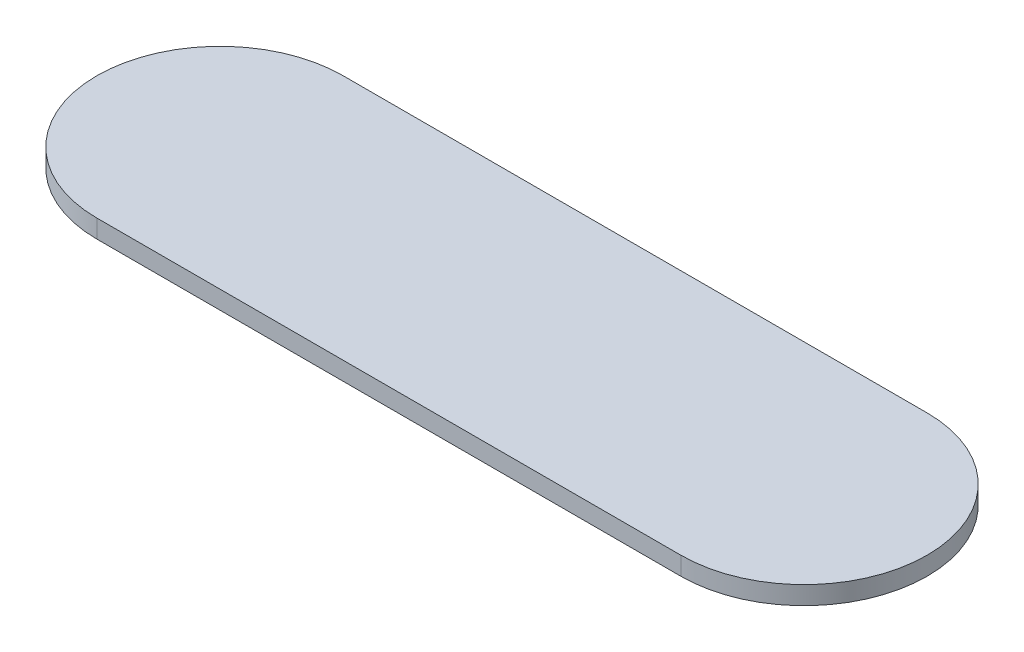
ISO-10303-21;
HEADER;
FILE_DESCRIPTION(('STEP AP214'),'2;1');
FILE_NAME('part.step','',(''),(''),'','','');
FILE_SCHEMA(('AUTOMOTIVE_DESIGN { 1 0 10303 214 1 1 1 1 }'));
ENDSEC;
DATA;
#1=APPLICATION_CONTEXT('core data for automotive mechanical design processes');
#2=APPLICATION_PROTOCOL_DEFINITION('international standard','automotive_design',2000,#1);
#3=PRODUCT_CONTEXT('',#1,'mechanical');
#4=PRODUCT('Part','Part','',(#3));
#5=PRODUCT_RELATED_PRODUCT_CATEGORY('part','',(#4));
#6=PRODUCT_DEFINITION_FORMATION('','',#4);
#7=PRODUCT_DEFINITION_CONTEXT('part definition',#1,'design');
#8=PRODUCT_DEFINITION('design','',#6,#7);
#9=PRODUCT_DEFINITION_SHAPE('','',#8);
#10=(LENGTH_UNIT() NAMED_UNIT(*) SI_UNIT(.MILLI.,.METRE.));
#11=(NAMED_UNIT(*) PLANE_ANGLE_UNIT() SI_UNIT($,.RADIAN.));
#12=(NAMED_UNIT(*) SI_UNIT($,.STERADIAN.) SOLID_ANGLE_UNIT());
#13=UNCERTAINTY_MEASURE_WITH_UNIT(LENGTH_MEASURE(1.E-05),#10,'distance_accuracy_value','');
#14=(GEOMETRIC_REPRESENTATION_CONTEXT(3) GLOBAL_UNCERTAINTY_ASSIGNED_CONTEXT((#13)) GLOBAL_UNIT_ASSIGNED_CONTEXT((#10,
#11,#12)) REPRESENTATION_CONTEXT('',''));
#15=CARTESIAN_POINT('',(0.,0.,0.));
#16=DIRECTION('',(0.,0.,1.));
#17=DIRECTION('',(1.,0.,0.));
#18=AXIS2_PLACEMENT_3D('',#15,#16,#17);
#19=CARTESIAN_POINT('',(32.,-1.,0.));
#20=DIRECTION('',(0.,-1.,0.));
#21=DIRECTION('',(0.,0.,-1.));
#22=AXIS2_PLACEMENT_3D('',#19,#20,#21);
#23=CYLINDRICAL_SURFACE('',#22,13.5);
#24=DIRECTION('',(0.,-1.,0.));
#25=VECTOR('',#24,1.);
#26=CARTESIAN_POINT('',(32.,1.,13.5));
#27=LINE('',#26,#25);
#28=CARTESIAN_POINT('',(32.,-1.,13.5));
#29=VERTEX_POINT('',#28);
#30=CARTESIAN_POINT('',(32.,1.,13.5));
#31=VERTEX_POINT('',#30);
#32=EDGE_CURVE('E80',#29,#31,#27,.F.);
#33=ORIENTED_EDGE('',*,*,#32,.F.);
#34=CARTESIAN_POINT('',(32.,-1.,0.));
#35=DIRECTION('',(0.,-1.,0.));
#36=DIRECTION('',(0.,0.,-1.));
#37=AXIS2_PLACEMENT_3D('',#34,#35,#36);
#38=CIRCLE('',#37,13.5);
#39=CARTESIAN_POINT('',(32.,-1.,-13.5));
#40=VERTEX_POINT('',#39);
#41=EDGE_CURVE('E38',#40,#29,#38,.T.);
#42=ORIENTED_EDGE('',*,*,#41,.F.);
#43=DIRECTION('',(0.,-1.,0.));
#44=VECTOR('',#43,1.);
#45=CARTESIAN_POINT('',(32.,1.,-13.5));
#46=LINE('',#45,#44);
#47=CARTESIAN_POINT('',(32.,1.,-13.5));
#48=VERTEX_POINT('',#47);
#49=EDGE_CURVE('E101',#48,#40,#46,.T.);
#50=ORIENTED_EDGE('',*,*,#49,.F.);
#51=CARTESIAN_POINT('',(32.,1.,0.));
#52=DIRECTION('',(0.,-1.,0.));
#53=DIRECTION('',(0.,0.,-1.));
#54=AXIS2_PLACEMENT_3D('',#51,#52,#53);
#55=CIRCLE('',#54,13.5);
#56=EDGE_CURVE('E11',#31,#48,#55,.F.);
#57=ORIENTED_EDGE('',*,*,#56,.F.);
#58=EDGE_LOOP('',(#33,#42,#50,#57));
#59=FACE_BOUND('',#58,.T.);
#60=ADVANCED_FACE('F31',(#59),#23,.T.);
#61=CARTESIAN_POINT('',(-32.,1.,0.));
#62=DIRECTION('',(0.,-1.,0.));
#63=DIRECTION('',(0.,0.,-1.));
#64=AXIS2_PLACEMENT_3D('',#61,#62,#63);
#65=CYLINDRICAL_SURFACE('',#64,13.5);
#66=DIRECTION('',(0.,-1.,0.));
#67=VECTOR('',#66,1.);
#68=CARTESIAN_POINT('',(-32.,1.,13.5));
#69=LINE('',#68,#67);
#70=CARTESIAN_POINT('',(-32.,1.,13.5));
#71=VERTEX_POINT('',#70);
#72=CARTESIAN_POINT('',(-32.,-1.,13.5));
#73=VERTEX_POINT('',#72);
#74=EDGE_CURVE('E73',#71,#73,#69,.T.);
#75=ORIENTED_EDGE('',*,*,#74,.F.);
#76=CARTESIAN_POINT('',(-32.,1.,0.));
#77=DIRECTION('',(0.,-1.,0.));
#78=DIRECTION('',(0.,0.,-1.));
#79=AXIS2_PLACEMENT_3D('',#76,#77,#78);
#80=CIRCLE('',#79,13.5);
#81=CARTESIAN_POINT('',(-32.,1.,-13.5));
#82=VERTEX_POINT('',#81);
#83=EDGE_CURVE('E81',#82,#71,#80,.F.);
#84=ORIENTED_EDGE('',*,*,#83,.F.);
#85=DIRECTION('',(0.,-1.,0.));
#86=VECTOR('',#85,1.);
#87=CARTESIAN_POINT('',(-32.,1.,-13.5));
#88=LINE('',#87,#86);
#89=CARTESIAN_POINT('',(-32.,-1.,-13.5));
#90=VERTEX_POINT('',#89);
#91=EDGE_CURVE('E76',#90,#82,#88,.F.);
#92=ORIENTED_EDGE('',*,*,#91,.F.);
#93=CARTESIAN_POINT('',(-32.,-1.,0.));
#94=DIRECTION('',(0.,-1.,0.));
#95=DIRECTION('',(0.,0.,-1.));
#96=AXIS2_PLACEMENT_3D('',#93,#94,#95);
#97=CIRCLE('',#96,13.5);
#98=EDGE_CURVE('E69',#73,#90,#97,.T.);
#99=ORIENTED_EDGE('',*,*,#98,.F.);
#100=EDGE_LOOP('',(#75,#84,#92,#99));
#101=FACE_BOUND('',#100,.T.);
#102=ADVANCED_FACE('F71',(#101),#65,.T.);
#103=CARTESIAN_POINT('',(-45.5,1.,13.5));
#104=DIRECTION('',(0.,0.,-1.));
#105=DIRECTION('',(-1.,0.,0.));
#106=AXIS2_PLACEMENT_3D('',#103,#104,#105);
#107=PLANE('',#106);
#108=DIRECTION('',(1.,0.,0.));
#109=VECTOR('',#108,1.);
#110=CARTESIAN_POINT('',(-45.5,-1.,13.5));
#111=LINE('',#110,#109);
#112=EDGE_CURVE('E87',#73,#29,#111,.T.);
#113=ORIENTED_EDGE('',*,*,#112,.T.);
#114=ORIENTED_EDGE('',*,*,#32,.T.);
#115=DIRECTION('',(1.,0.,0.));
#116=VECTOR('',#115,1.);
#117=CARTESIAN_POINT('',(-45.5,1.,13.5));
#118=LINE('',#117,#116);
#119=EDGE_CURVE('E88',#71,#31,#118,.T.);
#120=ORIENTED_EDGE('',*,*,#119,.F.);
#121=ORIENTED_EDGE('',*,*,#74,.T.);
#122=EDGE_LOOP('',(#113,#114,#120,#121));
#123=FACE_BOUND('',#122,.T.);
#124=ADVANCED_FACE('F85',(#123),#107,.F.);
#125=CARTESIAN_POINT('',(-45.5,1.,-13.5));
#126=DIRECTION('',(0.,0.,1.));
#127=DIRECTION('',(1.,0.,0.));
#128=AXIS2_PLACEMENT_3D('',#125,#126,#127);
#129=PLANE('',#128);
#130=DIRECTION('',(-1.,0.,0.));
#131=VECTOR('',#130,1.);
#132=CARTESIAN_POINT('',(-45.5,1.,-13.5));
#133=LINE('',#132,#131);
#134=EDGE_CURVE('E89',#48,#82,#133,.T.);
#135=ORIENTED_EDGE('',*,*,#134,.F.);
#136=ORIENTED_EDGE('',*,*,#49,.T.);
#137=DIRECTION('',(-1.,0.,0.));
#138=VECTOR('',#137,1.);
#139=CARTESIAN_POINT('',(-45.5,-1.,-13.5));
#140=LINE('',#139,#138);
#141=EDGE_CURVE('E92',#40,#90,#140,.T.);
#142=ORIENTED_EDGE('',*,*,#141,.T.);
#143=ORIENTED_EDGE('',*,*,#91,.T.);
#144=EDGE_LOOP('',(#135,#136,#142,#143));
#145=FACE_BOUND('',#144,.T.);
#146=ADVANCED_FACE('F104',(#145),#129,.F.);
#147=CARTESIAN_POINT('',(-45.5,1.,-13.5));
#148=DIRECTION('',(0.,-1.,0.));
#149=DIRECTION('',(0.,0.,-1.));
#150=AXIS2_PLACEMENT_3D('',#147,#148,#149);
#151=PLANE('',#150);
#152=ORIENTED_EDGE('',*,*,#119,.T.);
#153=ORIENTED_EDGE('',*,*,#56,.T.);
#154=ORIENTED_EDGE('',*,*,#134,.T.);
#155=ORIENTED_EDGE('',*,*,#83,.T.);
#156=EDGE_LOOP('',(#152,#153,#154,#155));
#157=FACE_BOUND('',#156,.T.);
#158=ADVANCED_FACE('F105',(#157),#151,.F.);
#159=CARTESIAN_POINT('',(-45.5,-1.,-13.5));
#160=DIRECTION('',(0.,-1.,0.));
#161=DIRECTION('',(0.,0.,-1.));
#162=AXIS2_PLACEMENT_3D('',#159,#160,#161);
#163=PLANE('',#162);
#164=ORIENTED_EDGE('',*,*,#141,.F.);
#165=ORIENTED_EDGE('',*,*,#41,.T.);
#166=ORIENTED_EDGE('',*,*,#112,.F.);
#167=ORIENTED_EDGE('',*,*,#98,.T.);
#168=EDGE_LOOP('',(#164,#165,#166,#167));
#169=FACE_BOUND('',#168,.T.);
#170=ADVANCED_FACE('F91',(#169),#163,.T.);
#171=CLOSED_SHELL('',(#60,#102,#124,#146,#158,#170));
#172=MANIFOLD_SOLID_BREP('B2',#171);
#173=ADVANCED_BREP_SHAPE_REPRESENTATION('',(#18,#172),#14);
#174=SHAPE_DEFINITION_REPRESENTATION(#9,#173);
ENDSEC;
END-ISO-10303-21;
